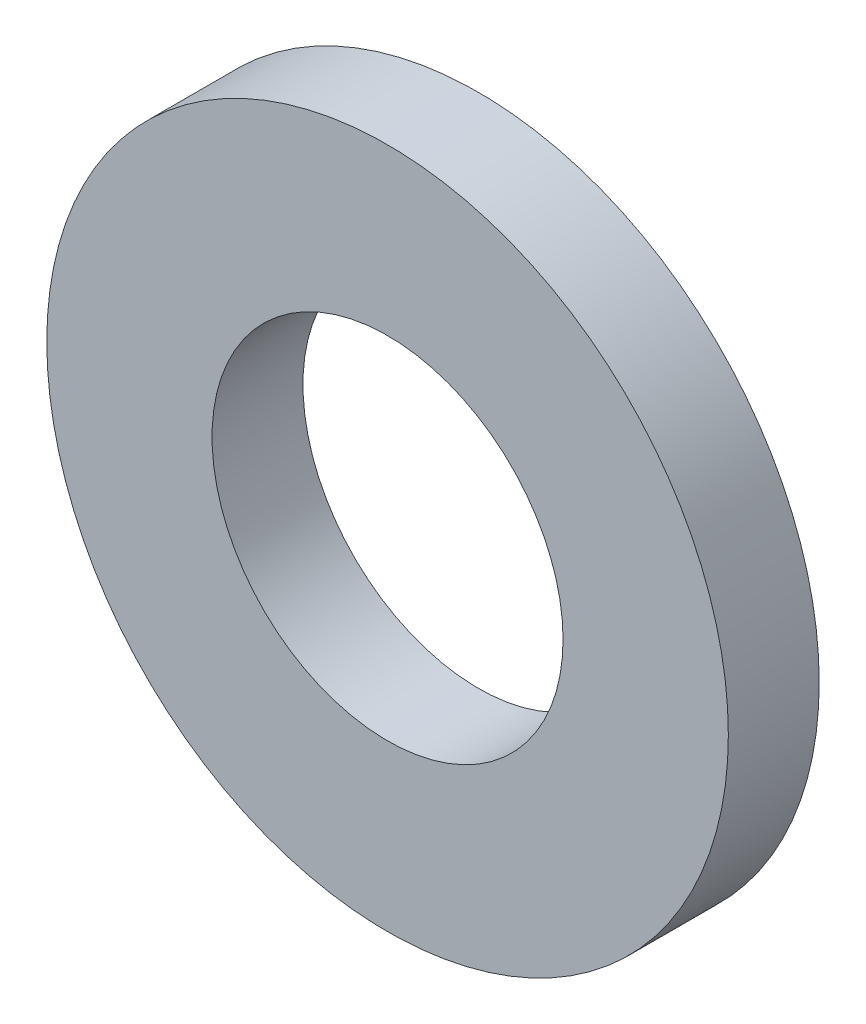
ISO-10303-21;
HEADER;
FILE_DESCRIPTION(('STEP AP214'),'2;1');
FILE_NAME('part.step','',(''),(''),'','','');
FILE_SCHEMA(('AUTOMOTIVE_DESIGN { 1 0 10303 214 1 1 1 1 }'));
ENDSEC;
DATA;
#1=APPLICATION_CONTEXT('core data for automotive mechanical design processes');
#2=APPLICATION_PROTOCOL_DEFINITION('international standard','automotive_design',2000,#1);
#3=PRODUCT_CONTEXT('',#1,'mechanical');
#4=PRODUCT('Part','Part','',(#3));
#5=PRODUCT_RELATED_PRODUCT_CATEGORY('part','',(#4));
#6=PRODUCT_DEFINITION_FORMATION('','',#4);
#7=PRODUCT_DEFINITION_CONTEXT('part definition',#1,'design');
#8=PRODUCT_DEFINITION('design','',#6,#7);
#9=PRODUCT_DEFINITION_SHAPE('','',#8);
#10=(LENGTH_UNIT() NAMED_UNIT(*) SI_UNIT(.MILLI.,.METRE.));
#11=(NAMED_UNIT(*) PLANE_ANGLE_UNIT() SI_UNIT($,.RADIAN.));
#12=(NAMED_UNIT(*) SI_UNIT($,.STERADIAN.) SOLID_ANGLE_UNIT());
#13=UNCERTAINTY_MEASURE_WITH_UNIT(LENGTH_MEASURE(1.E-05),#10,'distance_accuracy_value','');
#14=(GEOMETRIC_REPRESENTATION_CONTEXT(3) GLOBAL_UNCERTAINTY_ASSIGNED_CONTEXT((#13)) GLOBAL_UNIT_ASSIGNED_CONTEXT((#10,
#11,#12)) REPRESENTATION_CONTEXT('',''));
#15=CARTESIAN_POINT('',(0.,0.,0.));
#16=DIRECTION('',(0.,0.,1.));
#17=DIRECTION('',(1.,0.,0.));
#18=AXIS2_PLACEMENT_3D('',#15,#16,#17);
#19=CARTESIAN_POINT('',(0.,0.,-1.6));
#20=DIRECTION('',(0.,0.,1.));
#21=DIRECTION('',(1.,0.,0.));
#22=AXIS2_PLACEMENT_3D('',#19,#20,#21);
#23=CYLINDRICAL_SURFACE('',#22,6.);
#24=CARTESIAN_POINT('',(0.,0.,-1.6));
#25=DIRECTION('',(0.,0.,1.));
#26=DIRECTION('',(1.,0.,0.));
#27=AXIS2_PLACEMENT_3D('',#24,#25,#26);
#28=CIRCLE('',#27,6.);
#29=CARTESIAN_POINT('',(6.,0.,-1.6));
#30=VERTEX_POINT('',#29);
#31=EDGE_CURVE('E10',#30,#30,#28,.T.);
#32=ORIENTED_EDGE('',*,*,#31,.T.);
#33=EDGE_LOOP('',(#32));
#34=FACE_BOUND('',#33,.T.);
#35=CARTESIAN_POINT('',(0.,0.,0.));
#36=DIRECTION('',(0.,0.,1.));
#37=DIRECTION('',(1.,0.,0.));
#38=AXIS2_PLACEMENT_3D('',#35,#36,#37);
#39=CIRCLE('',#38,6.);
#40=CARTESIAN_POINT('',(6.,0.,0.));
#41=VERTEX_POINT('',#40);
#42=EDGE_CURVE('E33',#41,#41,#39,.T.);
#43=ORIENTED_EDGE('',*,*,#42,.F.);
#44=EDGE_LOOP('',(#43));
#45=FACE_BOUND('',#44,.T.);
#46=ADVANCED_FACE('F30',(#34,#45),#23,.T.);
#47=CARTESIAN_POINT('',(0.,0.,-1.6));
#48=DIRECTION('',(0.,0.,1.));
#49=DIRECTION('',(1.,0.,0.));
#50=AXIS2_PLACEMENT_3D('',#47,#48,#49);
#51=PLANE('',#50);
#52=CARTESIAN_POINT('',(0.,0.,-1.6));
#53=DIRECTION('',(0.,0.,1.));
#54=DIRECTION('',(1.,0.,0.));
#55=AXIS2_PLACEMENT_3D('',#52,#53,#54);
#56=CIRCLE('',#55,3.09);
#57=CARTESIAN_POINT('',(3.09,0.,-1.6));
#58=VERTEX_POINT('',#57);
#59=EDGE_CURVE('E40',#58,#58,#56,.T.);
#60=ORIENTED_EDGE('',*,*,#59,.T.);
#61=EDGE_LOOP('',(#60));
#62=FACE_BOUND('',#61,.T.);
#63=ORIENTED_EDGE('',*,*,#31,.F.);
#64=EDGE_LOOP('',(#63));
#65=FACE_BOUND('',#64,.T.);
#66=ADVANCED_FACE('F48',(#62,#65),#51,.F.);
#67=CARTESIAN_POINT('',(0.,0.,0.));
#68=DIRECTION('',(0.,0.,1.));
#69=DIRECTION('',(1.,0.,0.));
#70=AXIS2_PLACEMENT_3D('',#67,#68,#69);
#71=PLANE('',#70);
#72=CARTESIAN_POINT('',(0.,0.,0.));
#73=DIRECTION('',(0.,0.,1.));
#74=DIRECTION('',(1.,0.,0.));
#75=AXIS2_PLACEMENT_3D('',#72,#73,#74);
#76=CIRCLE('',#75,3.09);
#77=CARTESIAN_POINT('',(3.09,0.,0.));
#78=VERTEX_POINT('',#77);
#79=EDGE_CURVE('E42',#78,#78,#76,.T.);
#80=ORIENTED_EDGE('',*,*,#79,.F.);
#81=EDGE_LOOP('',(#80));
#82=FACE_BOUND('',#81,.T.);
#83=ORIENTED_EDGE('',*,*,#42,.T.);
#84=EDGE_LOOP('',(#83));
#85=FACE_BOUND('',#84,.T.);
#86=ADVANCED_FACE('F54',(#82,#85),#71,.T.);
#87=CARTESIAN_POINT('',(0.,0.,-1.6));
#88=DIRECTION('',(0.,0.,1.));
#89=DIRECTION('',(1.,0.,0.));
#90=AXIS2_PLACEMENT_3D('',#87,#88,#89);
#91=CYLINDRICAL_SURFACE('',#90,3.09);
#92=ORIENTED_EDGE('',*,*,#59,.F.);
#93=EDGE_LOOP('',(#92));
#94=FACE_BOUND('',#93,.T.);
#95=ORIENTED_EDGE('',*,*,#79,.T.);
#96=EDGE_LOOP('',(#95));
#97=FACE_BOUND('',#96,.T.);
#98=ADVANCED_FACE('F51',(#94,#97),#91,.F.);
#99=CLOSED_SHELL('',(#46,#66,#86,#98));
#100=MANIFOLD_SOLID_BREP('B2',#99);
#101=ADVANCED_BREP_SHAPE_REPRESENTATION('',(#18,#100),#14);
#102=SHAPE_DEFINITION_REPRESENTATION(#9,#101);
ENDSEC;
END-ISO-10303-21;
